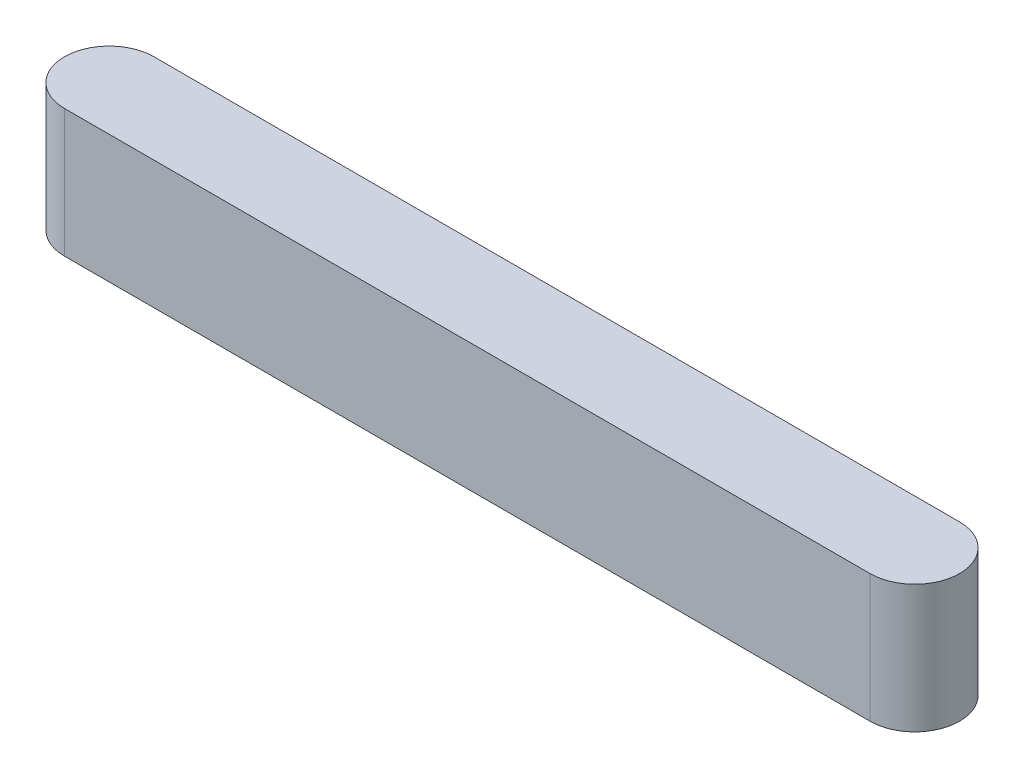
ISO-10303-21;
HEADER;
FILE_DESCRIPTION(('STEP AP214'),'2;1');
FILE_NAME('part.step','',(''),(''),'','','');
FILE_SCHEMA(('AUTOMOTIVE_DESIGN { 1 0 10303 214 1 1 1 1 }'));
ENDSEC;
DATA;
#1=APPLICATION_CONTEXT('core data for automotive mechanical design processes');
#2=APPLICATION_PROTOCOL_DEFINITION('international standard','automotive_design',2000,#1);
#3=PRODUCT_CONTEXT('',#1,'mechanical');
#4=PRODUCT('Part','Part','',(#3));
#5=PRODUCT_RELATED_PRODUCT_CATEGORY('part','',(#4));
#6=PRODUCT_DEFINITION_FORMATION('','',#4);
#7=PRODUCT_DEFINITION_CONTEXT('part definition',#1,'design');
#8=PRODUCT_DEFINITION('design','',#6,#7);
#9=PRODUCT_DEFINITION_SHAPE('','',#8);
#10=(LENGTH_UNIT() NAMED_UNIT(*) SI_UNIT(.MILLI.,.METRE.));
#11=(NAMED_UNIT(*) PLANE_ANGLE_UNIT() SI_UNIT($,.RADIAN.));
#12=(NAMED_UNIT(*) SI_UNIT($,.STERADIAN.) SOLID_ANGLE_UNIT());
#13=UNCERTAINTY_MEASURE_WITH_UNIT(LENGTH_MEASURE(1.E-05),#10,'distance_accuracy_value','');
#14=(GEOMETRIC_REPRESENTATION_CONTEXT(3) GLOBAL_UNCERTAINTY_ASSIGNED_CONTEXT((#13)) GLOBAL_UNIT_ASSIGNED_CONTEXT((#10,
#11,#12)) REPRESENTATION_CONTEXT('',''));
#15=CARTESIAN_POINT('',(0.,0.,0.));
#16=DIRECTION('',(0.,0.,1.));
#17=DIRECTION('',(1.,0.,0.));
#18=AXIS2_PLACEMENT_3D('',#15,#16,#17);
#19=CARTESIAN_POINT('',(9.,2.8575,0.));
#20=DIRECTION('',(0.,-1.,0.));
#21=DIRECTION('',(0.,0.,-1.));
#22=AXIS2_PLACEMENT_3D('',#19,#20,#21);
#23=CYLINDRICAL_SURFACE('',#22,1.);
#24=CARTESIAN_POINT('',(9.,0.,0.));
#25=DIRECTION('',(0.,1.,0.));
#26=DIRECTION('',(0.,0.,1.));
#27=AXIS2_PLACEMENT_3D('',#24,#25,#26);
#28=CIRCLE('',#27,1.);
#29=CARTESIAN_POINT('',(9.,0.,1.));
#30=VERTEX_POINT('',#29);
#31=CARTESIAN_POINT('',(9.,0.,-1.));
#32=VERTEX_POINT('',#31);
#33=EDGE_CURVE('E96',#30,#32,#28,.T.);
#34=ORIENTED_EDGE('',*,*,#33,.T.);
#35=DIRECTION('',(0.,-1.,0.));
#36=VECTOR('',#35,1.);
#37=CARTESIAN_POINT('',(9.,2.8575,-1.));
#38=LINE('',#37,#36);
#39=CARTESIAN_POINT('',(9.,2.8575,-1.));
#40=VERTEX_POINT('',#39);
#41=EDGE_CURVE('E11',#40,#32,#38,.T.);
#42=ORIENTED_EDGE('',*,*,#41,.F.);
#43=CARTESIAN_POINT('',(9.,2.8575,0.));
#44=DIRECTION('',(0.,1.,0.));
#45=DIRECTION('',(0.,0.,1.));
#46=AXIS2_PLACEMENT_3D('',#43,#44,#45);
#47=CIRCLE('',#46,1.);
#48=CARTESIAN_POINT('',(9.,2.8575,1.));
#49=VERTEX_POINT('',#48);
#50=EDGE_CURVE('E84',#49,#40,#47,.T.);
#51=ORIENTED_EDGE('',*,*,#50,.F.);
#52=DIRECTION('',(0.,-1.,0.));
#53=VECTOR('',#52,1.);
#54=CARTESIAN_POINT('',(9.,2.8575,1.));
#55=LINE('',#54,#53);
#56=EDGE_CURVE('E92',#49,#30,#55,.T.);
#57=ORIENTED_EDGE('',*,*,#56,.T.);
#58=EDGE_LOOP('',(#34,#42,#51,#57));
#59=FACE_BOUND('',#58,.T.);
#60=ADVANCED_FACE('F33',(#59),#23,.T.);
#61=CARTESIAN_POINT('',(-9.,2.8575,-1.));
#62=DIRECTION('',(0.,0.,1.));
#63=DIRECTION('',(1.,0.,0.));
#64=AXIS2_PLACEMENT_3D('',#61,#62,#63);
#65=PLANE('',#64);
#66=DIRECTION('',(-1.,0.,0.));
#67=VECTOR('',#66,1.);
#68=CARTESIAN_POINT('',(-9.,0.,-1.));
#69=LINE('',#68,#67);
#70=CARTESIAN_POINT('',(-9.,0.,-1.));
#71=VERTEX_POINT('',#70);
#72=EDGE_CURVE('E88',#32,#71,#69,.T.);
#73=ORIENTED_EDGE('',*,*,#72,.T.);
#74=DIRECTION('',(0.,-1.,0.));
#75=VECTOR('',#74,1.);
#76=CARTESIAN_POINT('',(-9.,2.8575,-1.));
#77=LINE('',#76,#75);
#78=CARTESIAN_POINT('',(-9.,2.8575,-1.));
#79=VERTEX_POINT('',#78);
#80=EDGE_CURVE('E41',#79,#71,#77,.T.);
#81=ORIENTED_EDGE('',*,*,#80,.F.);
#82=DIRECTION('',(-1.,0.,0.));
#83=VECTOR('',#82,1.);
#84=CARTESIAN_POINT('',(-9.,2.8575,-1.));
#85=LINE('',#84,#83);
#86=EDGE_CURVE('E79',#40,#79,#85,.T.);
#87=ORIENTED_EDGE('',*,*,#86,.F.);
#88=ORIENTED_EDGE('',*,*,#41,.T.);
#89=EDGE_LOOP('',(#73,#81,#87,#88));
#90=FACE_BOUND('',#89,.T.);
#91=ADVANCED_FACE('F87',(#90),#65,.F.);
#92=CARTESIAN_POINT('',(-9.,2.8575,0.));
#93=DIRECTION('',(0.,-1.,0.));
#94=DIRECTION('',(0.,0.,-1.));
#95=AXIS2_PLACEMENT_3D('',#92,#93,#94);
#96=CYLINDRICAL_SURFACE('',#95,1.);
#97=CARTESIAN_POINT('',(-9.,0.,0.));
#98=DIRECTION('',(0.,1.,0.));
#99=DIRECTION('',(0.,0.,1.));
#100=AXIS2_PLACEMENT_3D('',#97,#98,#99);
#101=CIRCLE('',#100,1.);
#102=CARTESIAN_POINT('',(-9.,0.,1.));
#103=VERTEX_POINT('',#102);
#104=EDGE_CURVE('E66',#71,#103,#101,.T.);
#105=ORIENTED_EDGE('',*,*,#104,.T.);
#106=DIRECTION('',(0.,-1.,0.));
#107=VECTOR('',#106,1.);
#108=CARTESIAN_POINT('',(-9.,2.8575,1.));
#109=LINE('',#108,#107);
#110=CARTESIAN_POINT('',(-9.,2.8575,1.));
#111=VERTEX_POINT('',#110);
#112=EDGE_CURVE('E89',#111,#103,#109,.T.);
#113=ORIENTED_EDGE('',*,*,#112,.F.);
#114=CARTESIAN_POINT('',(-9.,2.8575,0.));
#115=DIRECTION('',(0.,1.,0.));
#116=DIRECTION('',(0.,0.,1.));
#117=AXIS2_PLACEMENT_3D('',#114,#115,#116);
#118=CIRCLE('',#117,1.);
#119=EDGE_CURVE('E82',#79,#111,#118,.T.);
#120=ORIENTED_EDGE('',*,*,#119,.F.);
#121=ORIENTED_EDGE('',*,*,#80,.T.);
#122=EDGE_LOOP('',(#105,#113,#120,#121));
#123=FACE_BOUND('',#122,.T.);
#124=ADVANCED_FACE('F90',(#123),#96,.T.);
#125=CARTESIAN_POINT('',(-9.,2.8575,1.));
#126=DIRECTION('',(0.,0.,-1.));
#127=DIRECTION('',(-1.,0.,0.));
#128=AXIS2_PLACEMENT_3D('',#125,#126,#127);
#129=PLANE('',#128);
#130=DIRECTION('',(1.,0.,0.));
#131=VECTOR('',#130,1.);
#132=CARTESIAN_POINT('',(-9.,0.,1.));
#133=LINE('',#132,#131);
#134=EDGE_CURVE('E72',#103,#30,#133,.T.);
#135=ORIENTED_EDGE('',*,*,#134,.T.);
#136=ORIENTED_EDGE('',*,*,#56,.F.);
#137=DIRECTION('',(1.,0.,0.));
#138=VECTOR('',#137,1.);
#139=CARTESIAN_POINT('',(-9.,2.8575,1.));
#140=LINE('',#139,#138);
#141=EDGE_CURVE('E49',#111,#49,#140,.T.);
#142=ORIENTED_EDGE('',*,*,#141,.F.);
#143=ORIENTED_EDGE('',*,*,#112,.T.);
#144=EDGE_LOOP('',(#135,#136,#142,#143));
#145=FACE_BOUND('',#144,.T.);
#146=ADVANCED_FACE('F103',(#145),#129,.F.);
#147=CARTESIAN_POINT('',(9.,2.8575,0.));
#148=DIRECTION('',(0.,1.,0.));
#149=DIRECTION('',(0.,0.,1.));
#150=AXIS2_PLACEMENT_3D('',#147,#148,#149);
#151=PLANE('',#150);
#152=ORIENTED_EDGE('',*,*,#50,.T.);
#153=ORIENTED_EDGE('',*,*,#86,.T.);
#154=ORIENTED_EDGE('',*,*,#119,.T.);
#155=ORIENTED_EDGE('',*,*,#141,.T.);
#156=EDGE_LOOP('',(#152,#153,#154,#155));
#157=FACE_BOUND('',#156,.T.);
#158=ADVANCED_FACE('F80',(#157),#151,.T.);
#159=CARTESIAN_POINT('',(9.,0.,0.));
#160=DIRECTION('',(0.,1.,0.));
#161=DIRECTION('',(0.,0.,1.));
#162=AXIS2_PLACEMENT_3D('',#159,#160,#161);
#163=PLANE('',#162);
#164=ORIENTED_EDGE('',*,*,#33,.F.);
#165=ORIENTED_EDGE('',*,*,#134,.F.);
#166=ORIENTED_EDGE('',*,*,#104,.F.);
#167=ORIENTED_EDGE('',*,*,#72,.F.);
#168=EDGE_LOOP('',(#164,#165,#166,#167));
#169=FACE_BOUND('',#168,.T.);
#170=ADVANCED_FACE('F106',(#169),#163,.F.);
#171=CLOSED_SHELL('',(#60,#91,#124,#146,#158,#170));
#172=MANIFOLD_SOLID_BREP('B2',#171);
#173=ADVANCED_BREP_SHAPE_REPRESENTATION('',(#18,#172),#14);
#174=SHAPE_DEFINITION_REPRESENTATION(#9,#173);
ENDSEC;
END-ISO-10303-21;
